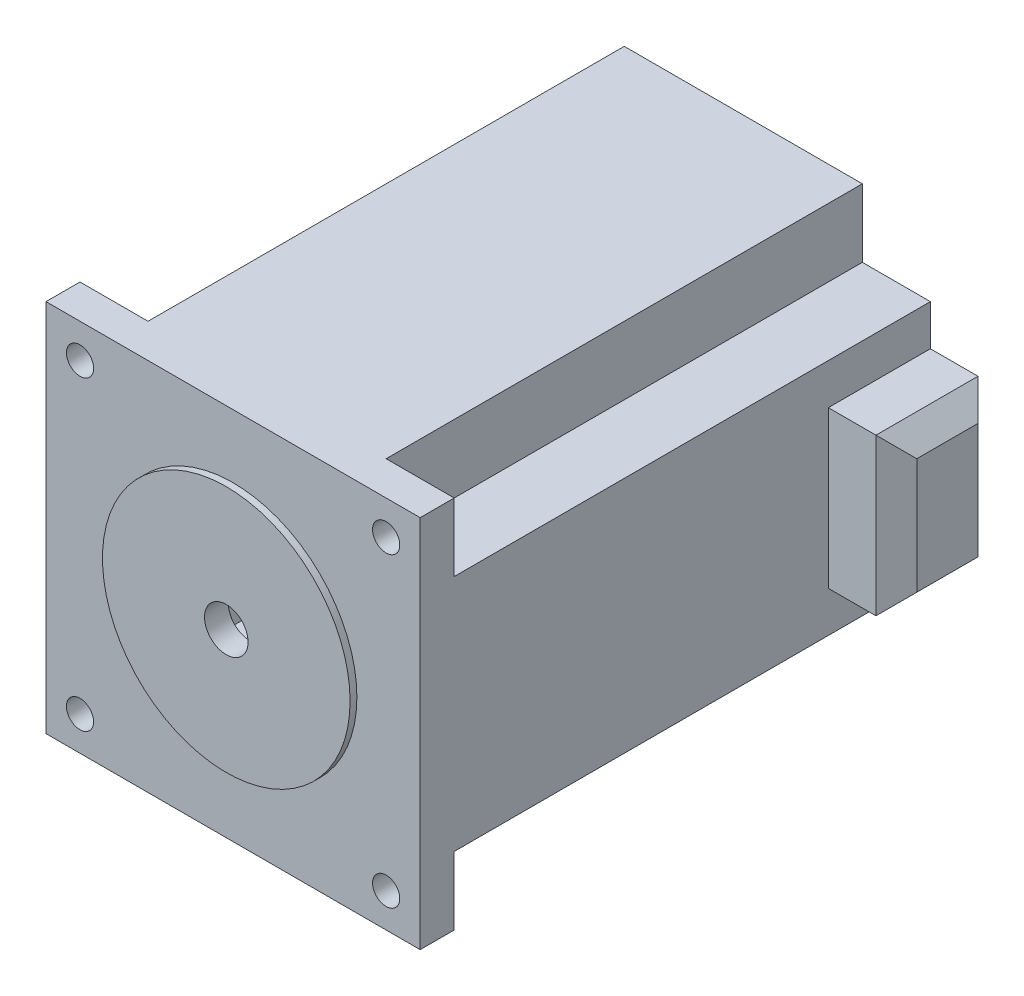
ISO-10303-21;
HEADER;
FILE_DESCRIPTION(('STEP AP214'),'2;1');
FILE_NAME('part.step','',(''),(''),'','','');
FILE_SCHEMA(('AUTOMOTIVE_DESIGN { 1 0 10303 214 1 1 1 1 }'));
ENDSEC;
DATA;
#1=APPLICATION_CONTEXT('core data for automotive mechanical design processes');
#2=APPLICATION_PROTOCOL_DEFINITION('international standard','automotive_design',2000,#1);
#3=PRODUCT_CONTEXT('',#1,'mechanical');
#4=PRODUCT('Part','Part','',(#3));
#5=PRODUCT_RELATED_PRODUCT_CATEGORY('part','',(#4));
#6=PRODUCT_DEFINITION_FORMATION('','',#4);
#7=PRODUCT_DEFINITION_CONTEXT('part definition',#1,'design');
#8=PRODUCT_DEFINITION('design','',#6,#7);
#9=PRODUCT_DEFINITION_SHAPE('','',#8);
#10=(LENGTH_UNIT() NAMED_UNIT(*) SI_UNIT(.MILLI.,.METRE.));
#11=(NAMED_UNIT(*) PLANE_ANGLE_UNIT() SI_UNIT($,.RADIAN.));
#12=(NAMED_UNIT(*) SI_UNIT($,.STERADIAN.) SOLID_ANGLE_UNIT());
#13=UNCERTAINTY_MEASURE_WITH_UNIT(LENGTH_MEASURE(1.E-05),#10,'distance_accuracy_value','');
#14=(GEOMETRIC_REPRESENTATION_CONTEXT(3) GLOBAL_UNCERTAINTY_ASSIGNED_CONTEXT((#13)) GLOBAL_UNIT_ASSIGNED_CONTEXT((#10,
#11,#12)) REPRESENTATION_CONTEXT('',''));
#15=CARTESIAN_POINT('',(0.,0.,0.));
#16=DIRECTION('',(0.,0.,1.));
#17=DIRECTION('',(1.,0.,0.));
#18=AXIS2_PLACEMENT_3D('',#15,#16,#17);
#19=CARTESIAN_POINT('',(27.5,27.5,35.));
#20=DIRECTION('',(-1.,0.,0.));
#21=DIRECTION('',(0.,0.,1.));
#22=AXIS2_PLACEMENT_3D('',#19,#20,#21);
#23=PLANE('',#22);
#24=DIRECTION('',(0.,-1.,0.));
#25=VECTOR('',#24,1.);
#26=CARTESIAN_POINT('',(27.5,-27.5,32.5));
#27=LINE('',#26,#25);
#28=CARTESIAN_POINT('',(27.5,-17.5,32.5));
#29=VERTEX_POINT('',#28);
#30=CARTESIAN_POINT('',(27.5,-27.5,32.5));
#31=VERTEX_POINT('',#30);
#32=EDGE_CURVE('E469',#29,#31,#27,.T.);
#33=ORIENTED_EDGE('',*,*,#32,.F.);
#34=DIRECTION('',(0.,0.,-1.));
#35=VECTOR('',#34,1.);
#36=CARTESIAN_POINT('',(27.5,-17.5,32.5));
#37=LINE('',#36,#35);
#38=CARTESIAN_POINT('',(27.5,-17.5,-37.5));
#39=VERTEX_POINT('',#38);
#40=EDGE_CURVE('E461',#29,#39,#37,.T.);
#41=ORIENTED_EDGE('',*,*,#40,.T.);
#42=DIRECTION('',(0.,-1.,0.));
#43=VECTOR('',#42,1.);
#44=CARTESIAN_POINT('',(27.5,27.5,-37.5));
#45=LINE('',#44,#43);
#46=CARTESIAN_POINT('',(27.5,-11.5,-37.5));
#47=VERTEX_POINT('',#46);
#48=EDGE_CURVE('E318',#47,#39,#45,.T.);
#49=ORIENTED_EDGE('',*,*,#48,.F.);
#50=DIRECTION('',(0.,0.,-1.));
#51=VECTOR('',#50,1.);
#52=CARTESIAN_POINT('',(27.5,-11.5,-22.5));
#53=LINE('',#52,#51);
#54=CARTESIAN_POINT('',(27.5,-11.5,-22.5));
#55=VERTEX_POINT('',#54);
#56=EDGE_CURVE('E282',#55,#47,#53,.T.);
#57=ORIENTED_EDGE('',*,*,#56,.F.);
#58=DIRECTION('',(0.,-1.,0.));
#59=VECTOR('',#58,1.);
#60=CARTESIAN_POINT('',(27.5,11.5,-22.5));
#61=LINE('',#60,#59);
#62=CARTESIAN_POINT('',(27.5,11.5,-22.5));
#63=VERTEX_POINT('',#62);
#64=EDGE_CURVE('E276',#63,#55,#61,.T.);
#65=ORIENTED_EDGE('',*,*,#64,.F.);
#66=DIRECTION('',(0.,0.,1.));
#67=VECTOR('',#66,1.);
#68=CARTESIAN_POINT('',(27.5,11.5,-22.5));
#69=LINE('',#68,#67);
#70=CARTESIAN_POINT('',(27.5,11.5,-37.5));
#71=VERTEX_POINT('',#70);
#72=EDGE_CURVE('E288',#71,#63,#69,.T.);
#73=ORIENTED_EDGE('',*,*,#72,.F.);
#74=CARTESIAN_POINT('',(27.5,17.5,-37.5));
#75=VERTEX_POINT('',#74);
#76=EDGE_CURVE('E321',#75,#71,#45,.T.);
#77=ORIENTED_EDGE('',*,*,#76,.F.);
#78=DIRECTION('',(0.,0.,-1.));
#79=VECTOR('',#78,1.);
#80=CARTESIAN_POINT('',(27.5,17.5,32.5));
#81=LINE('',#80,#79);
#82=CARTESIAN_POINT('',(27.5,17.5,32.5));
#83=VERTEX_POINT('',#82);
#84=EDGE_CURVE('E291',#83,#75,#81,.T.);
#85=ORIENTED_EDGE('',*,*,#84,.F.);
#86=DIRECTION('',(0.,-1.,0.));
#87=VECTOR('',#86,1.);
#88=CARTESIAN_POINT('',(27.5,27.5,32.5));
#89=LINE('',#88,#87);
#90=CARTESIAN_POINT('',(27.5,27.5,32.5));
#91=VERTEX_POINT('',#90);
#92=EDGE_CURVE('E505',#91,#83,#89,.T.);
#93=ORIENTED_EDGE('',*,*,#92,.F.);
#94=DIRECTION('',(0.,0.,-1.));
#95=VECTOR('',#94,1.);
#96=CARTESIAN_POINT('',(27.5,27.5,35.));
#97=LINE('',#96,#95);
#98=CARTESIAN_POINT('',(27.5,27.5,37.5));
#99=VERTEX_POINT('',#98);
#100=EDGE_CURVE('E234',#99,#91,#97,.T.);
#101=ORIENTED_EDGE('',*,*,#100,.F.);
#102=DIRECTION('',(0.,1.,0.));
#103=VECTOR('',#102,1.);
#104=CARTESIAN_POINT('',(27.5,27.5,37.5));
#105=LINE('',#104,#103);
#106=CARTESIAN_POINT('',(27.5,-27.5,37.5));
#107=VERTEX_POINT('',#106);
#108=EDGE_CURVE('E338',#107,#99,#105,.T.);
#109=ORIENTED_EDGE('',*,*,#108,.F.);
#110=DIRECTION('',(0.,0.,-1.));
#111=VECTOR('',#110,1.);
#112=CARTESIAN_POINT('',(27.5,-27.5,35.));
#113=LINE('',#112,#111);
#114=EDGE_CURVE('E238',#107,#31,#113,.T.);
#115=ORIENTED_EDGE('',*,*,#114,.T.);
#116=EDGE_LOOP('',(#33,#41,#49,#57,#65,#73,#77,#85,#93,#101,#109,#115));
#117=FACE_BOUND('',#116,.T.);
#118=ADVANCED_FACE('F33',(#117),#23,.F.);
#119=CARTESIAN_POINT('',(0.,0.,37.5));
#120=DIRECTION('',(0.,0.,1.));
#121=DIRECTION('',(1.,0.,0.));
#122=AXIS2_PLACEMENT_3D('',#119,#120,#121);
#123=PLANE('',#122);
#124=CARTESIAN_POINT('',(22.5,22.5,37.5));
#125=DIRECTION('',(0.,0.,1.));
#126=DIRECTION('',(1.,0.,0.));
#127=AXIS2_PLACEMENT_3D('',#124,#125,#126);
#128=CIRCLE('',#127,2.00000000000001);
#129=CARTESIAN_POINT('',(24.5,22.5,37.5));
#130=VERTEX_POINT('',#129);
#131=EDGE_CURVE('E580',#130,#130,#128,.T.);
#132=ORIENTED_EDGE('',*,*,#131,.F.);
#133=EDGE_LOOP('',(#132));
#134=FACE_BOUND('',#133,.T.);
#135=CARTESIAN_POINT('',(-22.5,-22.5,37.5));
#136=DIRECTION('',(0.,0.,1.));
#137=DIRECTION('',(1.,0.,0.));
#138=AXIS2_PLACEMENT_3D('',#135,#136,#137);
#139=CIRCLE('',#138,2.00000000000001);
#140=CARTESIAN_POINT('',(-20.5,-22.5,37.5));
#141=VERTEX_POINT('',#140);
#142=EDGE_CURVE('E574',#141,#141,#139,.T.);
#143=ORIENTED_EDGE('',*,*,#142,.F.);
#144=EDGE_LOOP('',(#143));
#145=FACE_BOUND('',#144,.T.);
#146=CARTESIAN_POINT('',(22.5,-22.5,37.5));
#147=DIRECTION('',(0.,0.,1.));
#148=DIRECTION('',(1.,0.,0.));
#149=AXIS2_PLACEMENT_3D('',#146,#147,#148);
#150=CIRCLE('',#149,2.00000000000001);
#151=CARTESIAN_POINT('',(24.5,-22.5,37.5));
#152=VERTEX_POINT('',#151);
#153=EDGE_CURVE('E568',#152,#152,#150,.T.);
#154=ORIENTED_EDGE('',*,*,#153,.F.);
#155=EDGE_LOOP('',(#154));
#156=FACE_BOUND('',#155,.T.);
#157=CARTESIAN_POINT('',(-22.5,22.5,37.5));
#158=DIRECTION('',(0.,0.,1.));
#159=DIRECTION('',(1.,0.,0.));
#160=AXIS2_PLACEMENT_3D('',#157,#158,#159);
#161=CIRCLE('',#160,2.00000000000001);
#162=CARTESIAN_POINT('',(-20.5,22.5,37.5));
#163=VERTEX_POINT('',#162);
#164=EDGE_CURVE('E562',#163,#163,#161,.T.);
#165=ORIENTED_EDGE('',*,*,#164,.F.);
#166=EDGE_LOOP('',(#165));
#167=FACE_BOUND('',#166,.T.);
#168=DIRECTION('',(0.,-1.,0.));
#169=VECTOR('',#168,1.);
#170=CARTESIAN_POINT('',(-27.5,27.5,37.5));
#171=LINE('',#170,#169);
#172=CARTESIAN_POINT('',(-27.5,27.5,37.5));
#173=VERTEX_POINT('',#172);
#174=CARTESIAN_POINT('',(-27.5,-27.5,37.5));
#175=VERTEX_POINT('',#174);
#176=EDGE_CURVE('E233',#173,#175,#171,.T.);
#177=ORIENTED_EDGE('',*,*,#176,.T.);
#178=DIRECTION('',(1.,0.,0.));
#179=VECTOR('',#178,1.);
#180=CARTESIAN_POINT('',(-27.5,-27.5,37.5));
#181=LINE('',#180,#179);
#182=EDGE_CURVE('E335',#175,#107,#181,.T.);
#183=ORIENTED_EDGE('',*,*,#182,.T.);
#184=ORIENTED_EDGE('',*,*,#108,.T.);
#185=DIRECTION('',(-1.,0.,0.));
#186=VECTOR('',#185,1.);
#187=CARTESIAN_POINT('',(-27.5,27.5,37.5));
#188=LINE('',#187,#186);
#189=EDGE_CURVE('E341',#99,#173,#188,.T.);
#190=ORIENTED_EDGE('',*,*,#189,.T.);
#191=EDGE_LOOP('',(#177,#183,#184,#190));
#192=FACE_BOUND('',#191,.T.);
#193=CARTESIAN_POINT('',(0.,0.,37.5));
#194=DIRECTION('',(0.,0.,1.));
#195=DIRECTION('',(1.,0.,0.));
#196=AXIS2_PLACEMENT_3D('',#193,#194,#195);
#197=CIRCLE('',#196,18.2);
#198=CARTESIAN_POINT('',(18.2,0.,37.5));
#199=VERTEX_POINT('',#198);
#200=EDGE_CURVE('E308',#199,#199,#197,.T.);
#201=ORIENTED_EDGE('',*,*,#200,.F.);
#202=EDGE_LOOP('',(#201));
#203=FACE_BOUND('',#202,.T.);
#204=ADVANCED_FACE('F401',(#134,#145,#156,#167,#192,#203),#123,.T.);
#205=CARTESIAN_POINT('',(-27.5,27.5,35.));
#206=DIRECTION('',(1.,0.,0.));
#207=DIRECTION('',(0.,1.,0.));
#208=AXIS2_PLACEMENT_3D('',#205,#206,#207);
#209=PLANE('',#208);
#210=DIRECTION('',(0.,1.,0.));
#211=VECTOR('',#210,1.);
#212=CARTESIAN_POINT('',(-27.5,27.5,32.5));
#213=LINE('',#212,#211);
#214=CARTESIAN_POINT('',(-27.5,17.5,32.5));
#215=VERTEX_POINT('',#214);
#216=CARTESIAN_POINT('',(-27.5,27.5,32.5));
#217=VERTEX_POINT('',#216);
#218=EDGE_CURVE('E210',#215,#217,#213,.T.);
#219=ORIENTED_EDGE('',*,*,#218,.F.);
#220=DIRECTION('',(0.,0.,-1.));
#221=VECTOR('',#220,1.);
#222=CARTESIAN_POINT('',(-27.5,17.5,32.5));
#223=LINE('',#222,#221);
#224=CARTESIAN_POINT('',(-27.5,17.5,-37.5));
#225=VERTEX_POINT('',#224);
#226=EDGE_CURVE('E520',#215,#225,#223,.T.);
#227=ORIENTED_EDGE('',*,*,#226,.T.);
#228=DIRECTION('',(0.,1.,0.));
#229=VECTOR('',#228,1.);
#230=CARTESIAN_POINT('',(-27.5,27.5,-37.5));
#231=LINE('',#230,#229);
#232=CARTESIAN_POINT('',(-27.5,-17.5,-37.5));
#233=VERTEX_POINT('',#232);
#234=EDGE_CURVE('E326',#233,#225,#231,.T.);
#235=ORIENTED_EDGE('',*,*,#234,.F.);
#236=DIRECTION('',(0.,0.,-1.));
#237=VECTOR('',#236,1.);
#238=CARTESIAN_POINT('',(-27.5,-17.5,32.5));
#239=LINE('',#238,#237);
#240=CARTESIAN_POINT('',(-27.5,-17.5,32.5));
#241=VERTEX_POINT('',#240);
#242=EDGE_CURVE('E58',#241,#233,#239,.T.);
#243=ORIENTED_EDGE('',*,*,#242,.F.);
#244=DIRECTION('',(0.,1.,0.));
#245=VECTOR('',#244,1.);
#246=CARTESIAN_POINT('',(-27.5,-27.5,32.5));
#247=LINE('',#246,#245);
#248=CARTESIAN_POINT('',(-27.5,-27.5,32.5));
#249=VERTEX_POINT('',#248);
#250=EDGE_CURVE('E484',#249,#241,#247,.T.);
#251=ORIENTED_EDGE('',*,*,#250,.F.);
#252=DIRECTION('',(0.,0.,-1.));
#253=VECTOR('',#252,1.);
#254=CARTESIAN_POINT('',(-27.5,-27.5,35.));
#255=LINE('',#254,#253);
#256=EDGE_CURVE('E247',#175,#249,#255,.T.);
#257=ORIENTED_EDGE('',*,*,#256,.F.);
#258=ORIENTED_EDGE('',*,*,#176,.F.);
#259=DIRECTION('',(0.,0.,-1.));
#260=VECTOR('',#259,1.);
#261=CARTESIAN_POINT('',(-27.5,27.5,35.));
#262=LINE('',#261,#260);
#263=EDGE_CURVE('E226',#173,#217,#262,.T.);
#264=ORIENTED_EDGE('',*,*,#263,.T.);
#265=EDGE_LOOP('',(#219,#227,#235,#243,#251,#257,#258,#264));
#266=FACE_BOUND('',#265,.T.);
#267=ADVANCED_FACE('F231',(#266),#209,.F.);
#268=CARTESIAN_POINT('',(-27.5,-27.5,35.));
#269=DIRECTION('',(0.,1.,0.));
#270=DIRECTION('',(0.,0.,1.));
#271=AXIS2_PLACEMENT_3D('',#268,#269,#270);
#272=PLANE('',#271);
#273=DIRECTION('',(-1.,0.,0.));
#274=VECTOR('',#273,1.);
#275=CARTESIAN_POINT('',(27.5,-27.5,-37.5));
#276=LINE('',#275,#274);
#277=CARTESIAN_POINT('',(17.5,-27.5,-37.5));
#278=VERTEX_POINT('',#277);
#279=CARTESIAN_POINT('',(-17.5,-27.5,-37.5));
#280=VERTEX_POINT('',#279);
#281=EDGE_CURVE('E323',#278,#280,#276,.T.);
#282=ORIENTED_EDGE('',*,*,#281,.F.);
#283=DIRECTION('',(0.,0.,-1.));
#284=VECTOR('',#283,1.);
#285=CARTESIAN_POINT('',(17.5,-27.5,32.5));
#286=LINE('',#285,#284);
#287=CARTESIAN_POINT('',(17.5,-27.5,32.5));
#288=VERTEX_POINT('',#287);
#289=EDGE_CURVE('E481',#288,#278,#286,.T.);
#290=ORIENTED_EDGE('',*,*,#289,.F.);
#291=DIRECTION('',(-1.,0.,0.));
#292=VECTOR('',#291,1.);
#293=CARTESIAN_POINT('',(27.5,-27.5,32.5));
#294=LINE('',#293,#292);
#295=EDGE_CURVE('E471',#31,#288,#294,.T.);
#296=ORIENTED_EDGE('',*,*,#295,.F.);
#297=ORIENTED_EDGE('',*,*,#114,.F.);
#298=ORIENTED_EDGE('',*,*,#182,.F.);
#299=ORIENTED_EDGE('',*,*,#256,.T.);
#300=DIRECTION('',(-1.,0.,0.));
#301=VECTOR('',#300,1.);
#302=CARTESIAN_POINT('',(-27.5,-27.5,32.5));
#303=LINE('',#302,#301);
#304=CARTESIAN_POINT('',(-17.5,-27.5,32.5));
#305=VERTEX_POINT('',#304);
#306=EDGE_CURVE('E494',#305,#249,#303,.T.);
#307=ORIENTED_EDGE('',*,*,#306,.F.);
#308=DIRECTION('',(0.,0.,-1.));
#309=VECTOR('',#308,1.);
#310=CARTESIAN_POINT('',(-17.5,-27.5,32.5));
#311=LINE('',#310,#309);
#312=EDGE_CURVE('E473',#305,#280,#311,.T.);
#313=ORIENTED_EDGE('',*,*,#312,.T.);
#314=EDGE_LOOP('',(#282,#290,#296,#297,#298,#299,#307,#313));
#315=FACE_BOUND('',#314,.T.);
#316=ADVANCED_FACE('F413',(#315),#272,.F.);
#317=CARTESIAN_POINT('',(-27.5,27.5,35.));
#318=DIRECTION('',(0.,-1.,0.));
#319=DIRECTION('',(0.,0.,-1.));
#320=AXIS2_PLACEMENT_3D('',#317,#318,#319);
#321=PLANE('',#320);
#322=DIRECTION('',(1.,0.,0.));
#323=VECTOR('',#322,1.);
#324=CARTESIAN_POINT('',(27.5,27.5,-37.5));
#325=LINE('',#324,#323);
#326=CARTESIAN_POINT('',(-17.5,27.5,-37.5));
#327=VERTEX_POINT('',#326);
#328=CARTESIAN_POINT('',(17.5,27.5,-37.5));
#329=VERTEX_POINT('',#328);
#330=EDGE_CURVE('E329',#327,#329,#325,.T.);
#331=ORIENTED_EDGE('',*,*,#330,.F.);
#332=DIRECTION('',(0.,0.,-1.));
#333=VECTOR('',#332,1.);
#334=CARTESIAN_POINT('',(-17.5,27.5,32.5));
#335=LINE('',#334,#333);
#336=CARTESIAN_POINT('',(-17.5,27.5,32.5));
#337=VERTEX_POINT('',#336);
#338=EDGE_CURVE('E50',#337,#327,#335,.T.);
#339=ORIENTED_EDGE('',*,*,#338,.F.);
#340=DIRECTION('',(1.,0.,0.));
#341=VECTOR('',#340,1.);
#342=CARTESIAN_POINT('',(-27.5,27.5,32.5));
#343=LINE('',#342,#341);
#344=EDGE_CURVE('E214',#217,#337,#343,.T.);
#345=ORIENTED_EDGE('',*,*,#344,.F.);
#346=ORIENTED_EDGE('',*,*,#263,.F.);
#347=ORIENTED_EDGE('',*,*,#189,.F.);
#348=ORIENTED_EDGE('',*,*,#100,.T.);
#349=DIRECTION('',(1.,0.,0.));
#350=VECTOR('',#349,1.);
#351=CARTESIAN_POINT('',(27.5,27.5,32.5));
#352=LINE('',#351,#350);
#353=CARTESIAN_POINT('',(17.5,27.5,32.5));
#354=VERTEX_POINT('',#353);
#355=EDGE_CURVE('E515',#354,#91,#352,.T.);
#356=ORIENTED_EDGE('',*,*,#355,.F.);
#357=DIRECTION('',(0.,0.,-1.));
#358=VECTOR('',#357,1.);
#359=CARTESIAN_POINT('',(17.5,27.5,32.5));
#360=LINE('',#359,#358);
#361=EDGE_CURVE('E268',#354,#329,#360,.T.);
#362=ORIENTED_EDGE('',*,*,#361,.T.);
#363=EDGE_LOOP('',(#331,#339,#345,#346,#347,#348,#356,#362));
#364=FACE_BOUND('',#363,.T.);
#365=ADVANCED_FACE('F224',(#364),#321,.F.);
#366=CARTESIAN_POINT('',(-15.,15.,35.));
#367=DIRECTION('',(1.,0.,0.));
#368=DIRECTION('',(0.,1.,0.));
#369=AXIS2_PLACEMENT_3D('',#366,#367,#368);
#370=PLANE('',#369);
#371=DIRECTION('',(0.,-1.,0.));
#372=VECTOR('',#371,1.);
#373=CARTESIAN_POINT('',(-15.,15.,-35.));
#374=LINE('',#373,#372);
#375=CARTESIAN_POINT('',(-15.,15.,-35.));
#376=VERTEX_POINT('',#375);
#377=CARTESIAN_POINT('',(-15.,-15.,-35.));
#378=VERTEX_POINT('',#377);
#379=EDGE_CURVE('E343',#376,#378,#374,.T.);
#380=ORIENTED_EDGE('',*,*,#379,.F.);
#381=DIRECTION('',(0.,0.,-1.));
#382=VECTOR('',#381,1.);
#383=CARTESIAN_POINT('',(-15.,15.,35.));
#384=LINE('',#383,#382);
#385=CARTESIAN_POINT('',(-15.,15.,35.));
#386=VERTEX_POINT('',#385);
#387=EDGE_CURVE('E357',#386,#376,#384,.T.);
#388=ORIENTED_EDGE('',*,*,#387,.F.);
#389=DIRECTION('',(0.,-1.,0.));
#390=VECTOR('',#389,1.);
#391=CARTESIAN_POINT('',(-15.,15.,35.));
#392=LINE('',#391,#390);
#393=CARTESIAN_POINT('',(-15.,-15.,35.));
#394=VERTEX_POINT('',#393);
#395=EDGE_CURVE('E344',#386,#394,#392,.T.);
#396=ORIENTED_EDGE('',*,*,#395,.T.);
#397=DIRECTION('',(0.,0.,-1.));
#398=VECTOR('',#397,1.);
#399=CARTESIAN_POINT('',(-15.,-15.,35.));
#400=LINE('',#399,#398);
#401=EDGE_CURVE('E235',#394,#378,#400,.T.);
#402=ORIENTED_EDGE('',*,*,#401,.T.);
#403=EDGE_LOOP('',(#380,#388,#396,#402));
#404=FACE_BOUND('',#403,.T.);
#405=ADVANCED_FACE('F385',(#404),#370,.T.);
#406=CARTESIAN_POINT('',(-15.,-15.,35.));
#407=DIRECTION('',(0.,1.,0.));
#408=DIRECTION('',(0.,0.,1.));
#409=AXIS2_PLACEMENT_3D('',#406,#407,#408);
#410=PLANE('',#409);
#411=DIRECTION('',(1.,0.,0.));
#412=VECTOR('',#411,1.);
#413=CARTESIAN_POINT('',(-15.,-15.,-35.));
#414=LINE('',#413,#412);
#415=CARTESIAN_POINT('',(15.,-15.,-35.));
#416=VERTEX_POINT('',#415);
#417=EDGE_CURVE('E360',#378,#416,#414,.T.);
#418=ORIENTED_EDGE('',*,*,#417,.F.);
#419=ORIENTED_EDGE('',*,*,#401,.F.);
#420=DIRECTION('',(1.,0.,0.));
#421=VECTOR('',#420,1.);
#422=CARTESIAN_POINT('',(-15.,-15.,35.));
#423=LINE('',#422,#421);
#424=CARTESIAN_POINT('',(15.,-15.,35.));
#425=VERTEX_POINT('',#424);
#426=EDGE_CURVE('E347',#394,#425,#423,.T.);
#427=ORIENTED_EDGE('',*,*,#426,.T.);
#428=DIRECTION('',(0.,0.,-1.));
#429=VECTOR('',#428,1.);
#430=CARTESIAN_POINT('',(15.,-15.,35.));
#431=LINE('',#430,#429);
#432=EDGE_CURVE('E241',#425,#416,#431,.T.);
#433=ORIENTED_EDGE('',*,*,#432,.T.);
#434=EDGE_LOOP('',(#418,#419,#427,#433));
#435=FACE_BOUND('',#434,.T.);
#436=ADVANCED_FACE('F373',(#435),#410,.T.);
#437=CARTESIAN_POINT('',(15.,15.,35.));
#438=DIRECTION('',(-1.,0.,0.));
#439=DIRECTION('',(0.,-1.,0.));
#440=AXIS2_PLACEMENT_3D('',#437,#438,#439);
#441=PLANE('',#440);
#442=DIRECTION('',(0.,1.,0.));
#443=VECTOR('',#442,1.);
#444=CARTESIAN_POINT('',(15.,15.,-35.));
#445=LINE('',#444,#443);
#446=CARTESIAN_POINT('',(15.,15.,-35.));
#447=VERTEX_POINT('',#446);
#448=EDGE_CURVE('E363',#416,#447,#445,.T.);
#449=ORIENTED_EDGE('',*,*,#448,.F.);
#450=ORIENTED_EDGE('',*,*,#432,.F.);
#451=DIRECTION('',(0.,1.,0.));
#452=VECTOR('',#451,1.);
#453=CARTESIAN_POINT('',(15.,15.,35.));
#454=LINE('',#453,#452);
#455=CARTESIAN_POINT('',(15.,15.,35.));
#456=VERTEX_POINT('',#455);
#457=EDGE_CURVE('E351',#425,#456,#454,.T.);
#458=ORIENTED_EDGE('',*,*,#457,.T.);
#459=DIRECTION('',(0.,0.,-1.));
#460=VECTOR('',#459,1.);
#461=CARTESIAN_POINT('',(15.,15.,35.));
#462=LINE('',#461,#460);
#463=EDGE_CURVE('E369',#456,#447,#462,.T.);
#464=ORIENTED_EDGE('',*,*,#463,.T.);
#465=EDGE_LOOP('',(#449,#450,#458,#464));
#466=FACE_BOUND('',#465,.T.);
#467=ADVANCED_FACE('F376',(#466),#441,.T.);
#468=CARTESIAN_POINT('',(-15.,15.,35.));
#469=DIRECTION('',(0.,-1.,0.));
#470=DIRECTION('',(0.,0.,-1.));
#471=AXIS2_PLACEMENT_3D('',#468,#469,#470);
#472=PLANE('',#471);
#473=DIRECTION('',(-1.,0.,0.));
#474=VECTOR('',#473,1.);
#475=CARTESIAN_POINT('',(-15.,15.,-35.));
#476=LINE('',#475,#474);
#477=EDGE_CURVE('E348',#447,#376,#476,.T.);
#478=ORIENTED_EDGE('',*,*,#477,.F.);
#479=ORIENTED_EDGE('',*,*,#463,.F.);
#480=DIRECTION('',(-1.,0.,0.));
#481=VECTOR('',#480,1.);
#482=CARTESIAN_POINT('',(-15.,15.,35.));
#483=LINE('',#482,#481);
#484=EDGE_CURVE('E354',#456,#386,#483,.T.);
#485=ORIENTED_EDGE('',*,*,#484,.T.);
#486=ORIENTED_EDGE('',*,*,#387,.T.);
#487=EDGE_LOOP('',(#478,#479,#485,#486));
#488=FACE_BOUND('',#487,.T.);
#489=ADVANCED_FACE('F390',(#488),#472,.T.);
#490=CARTESIAN_POINT('',(0.,0.,35.));
#491=DIRECTION('',(0.,0.,1.));
#492=DIRECTION('',(1.,0.,0.));
#493=AXIS2_PLACEMENT_3D('',#490,#491,#492);
#494=PLANE('',#493);
#495=ORIENTED_EDGE('',*,*,#395,.F.);
#496=ORIENTED_EDGE('',*,*,#484,.F.);
#497=ORIENTED_EDGE('',*,*,#457,.F.);
#498=ORIENTED_EDGE('',*,*,#426,.F.);
#499=EDGE_LOOP('',(#495,#496,#497,#498));
#500=FACE_BOUND('',#499,.T.);
#501=CARTESIAN_POINT('',(0.,0.,35.));
#502=DIRECTION('',(0.,0.,1.));
#503=DIRECTION('',(1.,0.,0.));
#504=AXIS2_PLACEMENT_3D('',#501,#502,#503);
#505=CIRCLE('',#504,3.2);
#506=CARTESIAN_POINT('',(3.2,0.,35.));
#507=VERTEX_POINT('',#506);
#508=EDGE_CURVE('E331',#507,#507,#505,.T.);
#509=ORIENTED_EDGE('',*,*,#508,.T.);
#510=EDGE_LOOP('',(#509));
#511=FACE_BOUND('',#510,.T.);
#512=ADVANCED_FACE('F387',(#500,#511),#494,.F.);
#513=CARTESIAN_POINT('',(0.,0.,37.5));
#514=DIRECTION('',(0.,0.,-1.));
#515=DIRECTION('',(-1.,0.,0.));
#516=AXIS2_PLACEMENT_3D('',#513,#514,#515);
#517=CYLINDRICAL_SURFACE('',#516,3.2);
#518=ORIENTED_EDGE('',*,*,#508,.F.);
#519=EDGE_LOOP('',(#518));
#520=FACE_BOUND('',#519,.T.);
#521=CARTESIAN_POINT('',(0.,0.,38.5));
#522=DIRECTION('',(0.,0.,1.));
#523=DIRECTION('',(1.,0.,0.));
#524=AXIS2_PLACEMENT_3D('',#521,#522,#523);
#525=CIRCLE('',#524,3.2);
#526=CARTESIAN_POINT('',(3.2,0.,38.5));
#527=VERTEX_POINT('',#526);
#528=EDGE_CURVE('E305',#527,#527,#525,.T.);
#529=ORIENTED_EDGE('',*,*,#528,.T.);
#530=EDGE_LOOP('',(#529));
#531=FACE_BOUND('',#530,.T.);
#532=ADVANCED_FACE('F397',(#520,#531),#517,.F.);
#533=CARTESIAN_POINT('',(0.,0.,-37.5));
#534=DIRECTION('',(0.,0.,-1.));
#535=DIRECTION('',(-1.,0.,0.));
#536=AXIS2_PLACEMENT_3D('',#533,#534,#535);
#537=PLANE('',#536);
#538=DIRECTION('',(-1.,0.,0.));
#539=VECTOR('',#538,1.);
#540=CARTESIAN_POINT('',(-27.5,17.5,-37.5));
#541=LINE('',#540,#539);
#542=CARTESIAN_POINT('',(-17.5,17.5,-37.5));
#543=VERTEX_POINT('',#542);
#544=EDGE_CURVE('E220',#543,#225,#541,.T.);
#545=ORIENTED_EDGE('',*,*,#544,.F.);
#546=DIRECTION('',(0.,-1.,0.));
#547=VECTOR('',#546,1.);
#548=CARTESIAN_POINT('',(-17.5,27.5,-37.5));
#549=LINE('',#548,#547);
#550=EDGE_CURVE('E478',#327,#543,#549,.T.);
#551=ORIENTED_EDGE('',*,*,#550,.F.);
#552=ORIENTED_EDGE('',*,*,#330,.T.);
#553=DIRECTION('',(0.,1.,0.));
#554=VECTOR('',#553,1.);
#555=CARTESIAN_POINT('',(17.5,27.5,-37.5));
#556=LINE('',#555,#554);
#557=CARTESIAN_POINT('',(17.5,17.5,-37.5));
#558=VERTEX_POINT('',#557);
#559=EDGE_CURVE('E509',#558,#329,#556,.T.);
#560=ORIENTED_EDGE('',*,*,#559,.F.);
#561=DIRECTION('',(-1.,0.,0.));
#562=VECTOR('',#561,1.);
#563=CARTESIAN_POINT('',(27.5,17.5,-37.5));
#564=LINE('',#563,#562);
#565=EDGE_CURVE('E517',#75,#558,#564,.T.);
#566=ORIENTED_EDGE('',*,*,#565,.F.);
#567=ORIENTED_EDGE('',*,*,#76,.T.);
#568=DIRECTION('',(-1.,0.,0.));
#569=VECTOR('',#568,1.);
#570=CARTESIAN_POINT('',(37.5,11.5,-37.5));
#571=LINE('',#570,#569);
#572=CARTESIAN_POINT('',(34.5,11.5,-37.5));
#573=VERTEX_POINT('',#572);
#574=EDGE_CURVE('E298',#573,#71,#571,.T.);
#575=ORIENTED_EDGE('',*,*,#574,.F.);
#576=DIRECTION('',(0.,-1.,0.));
#577=VECTOR('',#576,1.);
#578=CARTESIAN_POINT('',(34.5,0.,-37.5));
#579=LINE('',#578,#577);
#580=CARTESIAN_POINT('',(34.5,-11.5,-37.5));
#581=VERTEX_POINT('',#580);
#582=EDGE_CURVE('E262',#573,#581,#579,.T.);
#583=ORIENTED_EDGE('',*,*,#582,.T.);
#584=DIRECTION('',(-1.,0.,0.));
#585=VECTOR('',#584,1.);
#586=CARTESIAN_POINT('',(37.5,-11.5,-37.5));
#587=LINE('',#586,#585);
#588=EDGE_CURVE('E301',#581,#47,#587,.T.);
#589=ORIENTED_EDGE('',*,*,#588,.T.);
#590=ORIENTED_EDGE('',*,*,#48,.T.);
#591=DIRECTION('',(1.,0.,0.));
#592=VECTOR('',#591,1.);
#593=CARTESIAN_POINT('',(27.5,-17.5,-37.5));
#594=LINE('',#593,#592);
#595=CARTESIAN_POINT('',(17.5,-17.5,-37.5));
#596=VERTEX_POINT('',#595);
#597=EDGE_CURVE('E464',#596,#39,#594,.T.);
#598=ORIENTED_EDGE('',*,*,#597,.F.);
#599=DIRECTION('',(0.,1.,0.));
#600=VECTOR('',#599,1.);
#601=CARTESIAN_POINT('',(17.5,-27.5,-37.5));
#602=LINE('',#601,#600);
#603=EDGE_CURVE('E466',#278,#596,#602,.T.);
#604=ORIENTED_EDGE('',*,*,#603,.F.);
#605=ORIENTED_EDGE('',*,*,#281,.T.);
#606=DIRECTION('',(0.,-1.,0.));
#607=VECTOR('',#606,1.);
#608=CARTESIAN_POINT('',(-17.5,-27.5,-37.5));
#609=LINE('',#608,#607);
#610=CARTESIAN_POINT('',(-17.5,-17.5,-37.5));
#611=VERTEX_POINT('',#610);
#612=EDGE_CURVE('E488',#611,#280,#609,.T.);
#613=ORIENTED_EDGE('',*,*,#612,.F.);
#614=DIRECTION('',(1.,0.,0.));
#615=VECTOR('',#614,1.);
#616=CARTESIAN_POINT('',(-27.5,-17.5,-37.5));
#617=LINE('',#616,#615);
#618=EDGE_CURVE('E496',#233,#611,#617,.T.);
#619=ORIENTED_EDGE('',*,*,#618,.F.);
#620=ORIENTED_EDGE('',*,*,#234,.T.);
#621=EDGE_LOOP('',(#545,#551,#552,#560,#566,#567,#575,#583,#589,#590,#598,#604,#605,#613,#619,#620));
#622=FACE_BOUND('',#621,.T.);
#623=CARTESIAN_POINT('',(0.,0.,-37.5));
#624=DIRECTION('',(0.,0.,-1.));
#625=DIRECTION('',(-1.,0.,0.));
#626=AXIS2_PLACEMENT_3D('',#623,#624,#625);
#627=CIRCLE('',#626,3.2);
#628=CARTESIAN_POINT('',(-3.2,0.,-37.5));
#629=VERTEX_POINT('',#628);
#630=EDGE_CURVE('E315',#629,#629,#627,.T.);
#631=ORIENTED_EDGE('',*,*,#630,.F.);
#632=EDGE_LOOP('',(#631));
#633=FACE_BOUND('',#632,.T.);
#634=ADVANCED_FACE('F453',(#622,#633),#537,.T.);
#635=CARTESIAN_POINT('',(0.,0.,-35.));
#636=DIRECTION('',(0.,0.,-1.));
#637=DIRECTION('',(-1.,0.,0.));
#638=AXIS2_PLACEMENT_3D('',#635,#636,#637);
#639=PLANE('',#638);
#640=ORIENTED_EDGE('',*,*,#379,.T.);
#641=ORIENTED_EDGE('',*,*,#417,.T.);
#642=ORIENTED_EDGE('',*,*,#448,.T.);
#643=ORIENTED_EDGE('',*,*,#477,.T.);
#644=EDGE_LOOP('',(#640,#641,#642,#643));
#645=FACE_BOUND('',#644,.T.);
#646=CARTESIAN_POINT('',(0.,0.,-35.));
#647=DIRECTION('',(0.,0.,-1.));
#648=DIRECTION('',(-1.,0.,0.));
#649=AXIS2_PLACEMENT_3D('',#646,#647,#648);
#650=CIRCLE('',#649,3.2);
#651=CARTESIAN_POINT('',(-3.2,0.,-35.));
#652=VERTEX_POINT('',#651);
#653=EDGE_CURVE('E312',#652,#652,#650,.T.);
#654=ORIENTED_EDGE('',*,*,#653,.T.);
#655=EDGE_LOOP('',(#654));
#656=FACE_BOUND('',#655,.T.);
#657=ADVANCED_FACE('F380',(#645,#656),#639,.F.);
#658=CARTESIAN_POINT('',(0.,0.,-37.5));
#659=DIRECTION('',(0.,0.,1.));
#660=DIRECTION('',(1.,0.,0.));
#661=AXIS2_PLACEMENT_3D('',#658,#659,#660);
#662=CYLINDRICAL_SURFACE('',#661,3.2);
#663=ORIENTED_EDGE('',*,*,#630,.T.);
#664=EDGE_LOOP('',(#663));
#665=FACE_BOUND('',#664,.T.);
#666=ORIENTED_EDGE('',*,*,#653,.F.);
#667=EDGE_LOOP('',(#666));
#668=FACE_BOUND('',#667,.T.);
#669=ADVANCED_FACE('F660',(#665,#668),#662,.F.);
#670=CARTESIAN_POINT('',(0.,0.,38.5));
#671=DIRECTION('',(0.,0.,1.));
#672=DIRECTION('',(1.,0.,0.));
#673=AXIS2_PLACEMENT_3D('',#670,#671,#672);
#674=PLANE('',#673);
#675=CARTESIAN_POINT('',(0.,0.,38.5));
#676=DIRECTION('',(0.,0.,1.));
#677=DIRECTION('',(1.,0.,0.));
#678=AXIS2_PLACEMENT_3D('',#675,#676,#677);
#679=CIRCLE('',#678,18.2);
#680=CARTESIAN_POINT('',(18.2,0.,38.5));
#681=VERTEX_POINT('',#680);
#682=EDGE_CURVE('E309',#681,#681,#679,.T.);
#683=ORIENTED_EDGE('',*,*,#682,.T.);
#684=EDGE_LOOP('',(#683));
#685=FACE_BOUND('',#684,.T.);
#686=ORIENTED_EDGE('',*,*,#528,.F.);
#687=EDGE_LOOP('',(#686));
#688=FACE_BOUND('',#687,.T.);
#689=ADVANCED_FACE('F657',(#685,#688),#674,.T.);
#690=CARTESIAN_POINT('',(0.,0.,38.5));
#691=DIRECTION('',(0.,0.,-1.));
#692=DIRECTION('',(-1.,0.,0.));
#693=AXIS2_PLACEMENT_3D('',#690,#691,#692);
#694=CYLINDRICAL_SURFACE('',#693,18.2);
#695=ORIENTED_EDGE('',*,*,#682,.F.);
#696=EDGE_LOOP('',(#695));
#697=FACE_BOUND('',#696,.T.);
#698=ORIENTED_EDGE('',*,*,#200,.T.);
#699=EDGE_LOOP('',(#698));
#700=FACE_BOUND('',#699,.T.);
#701=ADVANCED_FACE('F656',(#697,#700),#694,.T.);
#702=CARTESIAN_POINT('',(37.5,11.5,-22.5));
#703=DIRECTION('',(0.,0.,-1.));
#704=DIRECTION('',(0.,1.,0.));
#705=AXIS2_PLACEMENT_3D('',#702,#703,#704);
#706=PLANE('',#705);
#707=DIRECTION('',(-1.,0.,0.));
#708=VECTOR('',#707,1.);
#709=CARTESIAN_POINT('',(37.5,-11.5,-22.5));
#710=LINE('',#709,#708);
#711=CARTESIAN_POINT('',(34.5,-11.5,-22.5));
#712=VERTEX_POINT('',#711);
#713=EDGE_CURVE('E303',#712,#55,#710,.T.);
#714=ORIENTED_EDGE('',*,*,#713,.F.);
#715=DIRECTION('',(0.,1.,0.));
#716=VECTOR('',#715,1.);
#717=CARTESIAN_POINT('',(34.5,11.5,-22.5));
#718=LINE('',#717,#716);
#719=CARTESIAN_POINT('',(34.5,11.5,-22.5));
#720=VERTEX_POINT('',#719);
#721=EDGE_CURVE('E11',#712,#720,#718,.T.);
#722=ORIENTED_EDGE('',*,*,#721,.T.);
#723=DIRECTION('',(-1.,0.,0.));
#724=VECTOR('',#723,1.);
#725=CARTESIAN_POINT('',(37.5,11.5,-22.5));
#726=LINE('',#725,#724);
#727=EDGE_CURVE('E296',#720,#63,#726,.T.);
#728=ORIENTED_EDGE('',*,*,#727,.T.);
#729=ORIENTED_EDGE('',*,*,#64,.T.);
#730=EDGE_LOOP('',(#714,#722,#728,#729));
#731=FACE_BOUND('',#730,.T.);
#732=ADVANCED_FACE('F443',(#731),#706,.F.);
#733=CARTESIAN_POINT('',(37.5,-11.5,-22.5));
#734=DIRECTION('',(0.,1.,0.));
#735=DIRECTION('',(0.,0.,1.));
#736=AXIS2_PLACEMENT_3D('',#733,#734,#735);
#737=PLANE('',#736);
#738=ORIENTED_EDGE('',*,*,#588,.F.);
#739=DIRECTION('',(0.,0.,1.));
#740=VECTOR('',#739,1.);
#741=CARTESIAN_POINT('',(34.5,-11.5,-22.5));
#742=LINE('',#741,#740);
#743=EDGE_CURVE('E42',#581,#712,#742,.T.);
#744=ORIENTED_EDGE('',*,*,#743,.T.);
#745=ORIENTED_EDGE('',*,*,#713,.T.);
#746=ORIENTED_EDGE('',*,*,#56,.T.);
#747=EDGE_LOOP('',(#738,#744,#745,#746));
#748=FACE_BOUND('',#747,.T.);
#749=ADVANCED_FACE('F458',(#748),#737,.F.);
#750=CARTESIAN_POINT('',(37.5,11.5,-22.5));
#751=DIRECTION('',(0.,-1.,0.));
#752=DIRECTION('',(0.,0.,-1.));
#753=AXIS2_PLACEMENT_3D('',#750,#751,#752);
#754=PLANE('',#753);
#755=ORIENTED_EDGE('',*,*,#727,.F.);
#756=DIRECTION('',(0.,0.,-1.));
#757=VECTOR('',#756,1.);
#758=CARTESIAN_POINT('',(34.5,11.5,-37.5));
#759=LINE('',#758,#757);
#760=EDGE_CURVE('E259',#720,#573,#759,.T.);
#761=ORIENTED_EDGE('',*,*,#760,.T.);
#762=ORIENTED_EDGE('',*,*,#574,.T.);
#763=ORIENTED_EDGE('',*,*,#72,.T.);
#764=EDGE_LOOP('',(#755,#761,#762,#763));
#765=FACE_BOUND('',#764,.T.);
#766=ADVANCED_FACE('F436',(#765),#754,.F.);
#767=CARTESIAN_POINT('',(37.5,0.,0.));
#768=DIRECTION('',(1.,0.,0.));
#769=DIRECTION('',(0.,0.,-1.));
#770=AXIS2_PLACEMENT_3D('',#767,#768,#769);
#771=PLANE('',#770);
#772=DIRECTION('',(0.,1.,0.));
#773=VECTOR('',#772,1.);
#774=CARTESIAN_POINT('',(37.5,0.,-34.5));
#775=LINE('',#774,#773);
#776=CARTESIAN_POINT('',(37.5,-8.49999999999999,-34.5));
#777=VERTEX_POINT('',#776);
#778=CARTESIAN_POINT('',(37.5,8.49999999999999,-34.5));
#779=VERTEX_POINT('',#778);
#780=EDGE_CURVE('E254',#777,#779,#775,.T.);
#781=ORIENTED_EDGE('',*,*,#780,.T.);
#782=DIRECTION('',(0.,0.,1.));
#783=VECTOR('',#782,1.);
#784=CARTESIAN_POINT('',(37.5,8.5,-22.5));
#785=LINE('',#784,#783);
#786=CARTESIAN_POINT('',(37.5,8.5,-25.5));
#787=VERTEX_POINT('',#786);
#788=EDGE_CURVE('E256',#779,#787,#785,.T.);
#789=ORIENTED_EDGE('',*,*,#788,.T.);
#790=DIRECTION('',(0.,-1.,0.));
#791=VECTOR('',#790,1.);
#792=CARTESIAN_POINT('',(37.5,-11.5,-25.5));
#793=LINE('',#792,#791);
#794=CARTESIAN_POINT('',(37.5,-8.49999999999999,-25.5));
#795=VERTEX_POINT('',#794);
#796=EDGE_CURVE('E250',#787,#795,#793,.T.);
#797=ORIENTED_EDGE('',*,*,#796,.T.);
#798=DIRECTION('',(0.,0.,-1.));
#799=VECTOR('',#798,1.);
#800=CARTESIAN_POINT('',(37.5,-8.49999999999999,-37.5));
#801=LINE('',#800,#799);
#802=EDGE_CURVE('E252',#795,#777,#801,.T.);
#803=ORIENTED_EDGE('',*,*,#802,.T.);
#804=EDGE_LOOP('',(#781,#789,#797,#803));
#805=FACE_BOUND('',#804,.T.);
#806=ADVANCED_FACE('F431',(#805),#771,.T.);
#807=CARTESIAN_POINT('',(37.5,-8.50000000000001,0.));
#808=DIRECTION('',(0.707106781186546,-0.707106781186549,0.));
#809=DIRECTION('',(0.,0.,1.));
#810=AXIS2_PLACEMENT_3D('',#807,#808,#809);
#811=PLANE('',#810);
#812=DIRECTION('',(0.577350269189628,0.577350269189625,-0.577350269189625));
#813=VECTOR('',#812,1.);
#814=CARTESIAN_POINT('',(40.3333333333333,-5.66666666666667,-28.3333333333333));
#815=LINE('',#814,#813);
#816=EDGE_CURVE('E269',#712,#795,#815,.T.);
#817=ORIENTED_EDGE('',*,*,#816,.F.);
#818=ORIENTED_EDGE('',*,*,#743,.F.);
#819=DIRECTION('',(-0.577350269189628,-0.577350269189625,-0.577350269189625));
#820=VECTOR('',#819,1.);
#821=CARTESIAN_POINT('',(49.,2.99999999999996,-23.));
#822=LINE('',#821,#820);
#823=EDGE_CURVE('E37',#777,#581,#822,.T.);
#824=ORIENTED_EDGE('',*,*,#823,.F.);
#825=ORIENTED_EDGE('',*,*,#802,.F.);
#826=EDGE_LOOP('',(#817,#818,#824,#825));
#827=FACE_BOUND('',#826,.T.);
#828=ADVANCED_FACE('F35',(#827),#811,.T.);
#829=CARTESIAN_POINT('',(37.5,0.,-34.5));
#830=DIRECTION('',(-0.707106781186546,0.,0.707106781186549));
#831=DIRECTION('',(0.,1.,0.));
#832=AXIS2_PLACEMENT_3D('',#829,#830,#831);
#833=PLANE('',#832);
#834=ORIENTED_EDGE('',*,*,#823,.T.);
#835=ORIENTED_EDGE('',*,*,#582,.F.);
#836=DIRECTION('',(-0.577350269189628,0.577350269189625,-0.577350269189625));
#837=VECTOR('',#836,1.);
#838=CARTESIAN_POINT('',(40.3333333333333,5.66666666666667,-31.6666666666667));
#839=LINE('',#838,#837);
#840=EDGE_CURVE('E267',#779,#573,#839,.T.);
#841=ORIENTED_EDGE('',*,*,#840,.F.);
#842=ORIENTED_EDGE('',*,*,#780,.F.);
#843=EDGE_LOOP('',(#834,#835,#841,#842));
#844=FACE_BOUND('',#843,.T.);
#845=ADVANCED_FACE('F426',(#844),#833,.F.);
#846=CARTESIAN_POINT('',(37.5,0.,-25.5));
#847=DIRECTION('',(0.707106781186546,0.,0.707106781186549));
#848=DIRECTION('',(0.,1.,0.));
#849=AXIS2_PLACEMENT_3D('',#846,#847,#848);
#850=PLANE('',#849);
#851=ORIENTED_EDGE('',*,*,#816,.T.);
#852=ORIENTED_EDGE('',*,*,#796,.F.);
#853=DIRECTION('',(-0.577350269189627,0.577350269189625,0.577350269189625));
#854=VECTOR('',#853,1.);
#855=CARTESIAN_POINT('',(40.3333333333333,5.66666666666667,-28.3333333333333));
#856=LINE('',#855,#854);
#857=EDGE_CURVE('E265',#720,#787,#856,.F.);
#858=ORIENTED_EDGE('',*,*,#857,.F.);
#859=ORIENTED_EDGE('',*,*,#721,.F.);
#860=EDGE_LOOP('',(#851,#852,#858,#859));
#861=FACE_BOUND('',#860,.T.);
#862=ADVANCED_FACE('F423',(#861),#850,.T.);
#863=CARTESIAN_POINT('',(37.5,8.5,0.));
#864=DIRECTION('',(0.707106781186546,0.707106781186549,0.));
#865=DIRECTION('',(0.,0.,-1.));
#866=AXIS2_PLACEMENT_3D('',#863,#864,#865);
#867=PLANE('',#866);
#868=ORIENTED_EDGE('',*,*,#840,.T.);
#869=ORIENTED_EDGE('',*,*,#760,.F.);
#870=ORIENTED_EDGE('',*,*,#857,.T.);
#871=ORIENTED_EDGE('',*,*,#788,.F.);
#872=EDGE_LOOP('',(#868,#869,#870,#871));
#873=FACE_BOUND('',#872,.T.);
#874=ADVANCED_FACE('F419',(#873),#867,.T.);
#875=CARTESIAN_POINT('',(17.5,27.5,32.5));
#876=DIRECTION('',(-1.,0.,0.));
#877=DIRECTION('',(0.,0.,1.));
#878=AXIS2_PLACEMENT_3D('',#875,#876,#877);
#879=PLANE('',#878);
#880=ORIENTED_EDGE('',*,*,#559,.T.);
#881=ORIENTED_EDGE('',*,*,#361,.F.);
#882=DIRECTION('',(0.,1.,0.));
#883=VECTOR('',#882,1.);
#884=CARTESIAN_POINT('',(17.5,27.5,32.5));
#885=LINE('',#884,#883);
#886=CARTESIAN_POINT('',(17.5,17.5,32.5));
#887=VERTEX_POINT('',#886);
#888=EDGE_CURVE('E512',#887,#354,#885,.T.);
#889=ORIENTED_EDGE('',*,*,#888,.F.);
#890=DIRECTION('',(0.,0.,-1.));
#891=VECTOR('',#890,1.);
#892=CARTESIAN_POINT('',(17.5,17.5,32.5));
#893=LINE('',#892,#891);
#894=EDGE_CURVE('E524',#887,#558,#893,.T.);
#895=ORIENTED_EDGE('',*,*,#894,.T.);
#896=EDGE_LOOP('',(#880,#881,#889,#895));
#897=FACE_BOUND('',#896,.T.);
#898=ADVANCED_FACE('F422',(#897),#879,.F.);
#899=CARTESIAN_POINT('',(27.5,17.5,32.5));
#900=DIRECTION('',(0.,-1.,0.));
#901=DIRECTION('',(0.,0.,-1.));
#902=AXIS2_PLACEMENT_3D('',#899,#900,#901);
#903=PLANE('',#902);
#904=ORIENTED_EDGE('',*,*,#565,.T.);
#905=ORIENTED_EDGE('',*,*,#894,.F.);
#906=DIRECTION('',(-1.,0.,0.));
#907=VECTOR('',#906,1.);
#908=CARTESIAN_POINT('',(27.5,17.5,32.5));
#909=LINE('',#908,#907);
#910=EDGE_CURVE('E508',#83,#887,#909,.T.);
#911=ORIENTED_EDGE('',*,*,#910,.F.);
#912=ORIENTED_EDGE('',*,*,#84,.T.);
#913=EDGE_LOOP('',(#904,#905,#911,#912));
#914=FACE_BOUND('',#913,.T.);
#915=ADVANCED_FACE('F530',(#914),#903,.F.);
#916=CARTESIAN_POINT('',(0.,0.,32.5));
#917=DIRECTION('',(0.,0.,-1.));
#918=DIRECTION('',(-1.,0.,0.));
#919=AXIS2_PLACEMENT_3D('',#916,#917,#918);
#920=PLANE('',#919);
#921=CARTESIAN_POINT('',(22.5,22.5,32.5));
#922=DIRECTION('',(0.,0.,1.));
#923=DIRECTION('',(1.,0.,0.));
#924=AXIS2_PLACEMENT_3D('',#921,#922,#923);
#925=CIRCLE('',#924,2.00000000000001);
#926=CARTESIAN_POINT('',(24.5,22.5,32.5));
#927=VERTEX_POINT('',#926);
#928=EDGE_CURVE('E565',#927,#927,#925,.T.);
#929=ORIENTED_EDGE('',*,*,#928,.T.);
#930=EDGE_LOOP('',(#929));
#931=FACE_BOUND('',#930,.T.);
#932=ORIENTED_EDGE('',*,*,#92,.T.);
#933=ORIENTED_EDGE('',*,*,#910,.T.);
#934=ORIENTED_EDGE('',*,*,#888,.T.);
#935=ORIENTED_EDGE('',*,*,#355,.T.);
#936=EDGE_LOOP('',(#932,#933,#934,#935));
#937=FACE_BOUND('',#936,.T.);
#938=ADVANCED_FACE('F536',(#931,#937),#920,.T.);
#939=CARTESIAN_POINT('',(-17.5,-27.5,32.5));
#940=DIRECTION('',(1.,0.,0.));
#941=DIRECTION('',(0.,0.,-1.));
#942=AXIS2_PLACEMENT_3D('',#939,#940,#941);
#943=PLANE('',#942);
#944=ORIENTED_EDGE('',*,*,#612,.T.);
#945=ORIENTED_EDGE('',*,*,#312,.F.);
#946=DIRECTION('',(0.,-1.,0.));
#947=VECTOR('',#946,1.);
#948=CARTESIAN_POINT('',(-17.5,-27.5,32.5));
#949=LINE('',#948,#947);
#950=CARTESIAN_POINT('',(-17.5,-17.5,32.5));
#951=VERTEX_POINT('',#950);
#952=EDGE_CURVE('E491',#951,#305,#949,.T.);
#953=ORIENTED_EDGE('',*,*,#952,.F.);
#954=DIRECTION('',(0.,0.,-1.));
#955=VECTOR('',#954,1.);
#956=CARTESIAN_POINT('',(-17.5,-17.5,32.5));
#957=LINE('',#956,#955);
#958=EDGE_CURVE('E502',#951,#611,#957,.T.);
#959=ORIENTED_EDGE('',*,*,#958,.T.);
#960=EDGE_LOOP('',(#944,#945,#953,#959));
#961=FACE_BOUND('',#960,.T.);
#962=ADVANCED_FACE('F638',(#961),#943,.F.);
#963=CARTESIAN_POINT('',(-27.5,-17.5,32.5));
#964=DIRECTION('',(0.,1.,0.));
#965=DIRECTION('',(0.,0.,1.));
#966=AXIS2_PLACEMENT_3D('',#963,#964,#965);
#967=PLANE('',#966);
#968=ORIENTED_EDGE('',*,*,#618,.T.);
#969=ORIENTED_EDGE('',*,*,#958,.F.);
#970=DIRECTION('',(1.,0.,0.));
#971=VECTOR('',#970,1.);
#972=CARTESIAN_POINT('',(-27.5,-17.5,32.5));
#973=LINE('',#972,#971);
#974=EDGE_CURVE('E487',#241,#951,#973,.T.);
#975=ORIENTED_EDGE('',*,*,#974,.F.);
#976=ORIENTED_EDGE('',*,*,#242,.T.);
#977=EDGE_LOOP('',(#968,#969,#975,#976));
#978=FACE_BOUND('',#977,.T.);
#979=ADVANCED_FACE('F636',(#978),#967,.F.);
#980=CARTESIAN_POINT('',(0.,0.,32.5));
#981=DIRECTION('',(0.,0.,-1.));
#982=DIRECTION('',(-1.,0.,0.));
#983=AXIS2_PLACEMENT_3D('',#980,#981,#982);
#984=PLANE('',#983);
#985=CARTESIAN_POINT('',(-22.5,-22.5,32.5));
#986=DIRECTION('',(0.,0.,1.));
#987=DIRECTION('',(1.,0.,0.));
#988=AXIS2_PLACEMENT_3D('',#985,#986,#987);
#989=CIRCLE('',#988,2.00000000000001);
#990=CARTESIAN_POINT('',(-20.5,-22.5,32.5));
#991=VERTEX_POINT('',#990);
#992=EDGE_CURVE('E577',#991,#991,#989,.T.);
#993=ORIENTED_EDGE('',*,*,#992,.T.);
#994=EDGE_LOOP('',(#993));
#995=FACE_BOUND('',#994,.T.);
#996=ORIENTED_EDGE('',*,*,#250,.T.);
#997=ORIENTED_EDGE('',*,*,#974,.T.);
#998=ORIENTED_EDGE('',*,*,#952,.T.);
#999=ORIENTED_EDGE('',*,*,#306,.T.);
#1000=EDGE_LOOP('',(#996,#997,#998,#999));
#1001=FACE_BOUND('',#1000,.T.);
#1002=ADVANCED_FACE('F630',(#995,#1001),#984,.T.);
#1003=CARTESIAN_POINT('',(27.5,-17.5,32.5));
#1004=DIRECTION('',(0.,1.,0.));
#1005=DIRECTION('',(0.,0.,1.));
#1006=AXIS2_PLACEMENT_3D('',#1003,#1004,#1005);
#1007=PLANE('',#1006);
#1008=ORIENTED_EDGE('',*,*,#597,.T.);
#1009=ORIENTED_EDGE('',*,*,#40,.F.);
#1010=DIRECTION('',(1.,0.,0.));
#1011=VECTOR('',#1010,1.);
#1012=CARTESIAN_POINT('',(27.5,-17.5,32.5));
#1013=LINE('',#1012,#1011);
#1014=CARTESIAN_POINT('',(17.5,-17.5,32.5));
#1015=VERTEX_POINT('',#1014);
#1016=EDGE_CURVE('E483',#1015,#29,#1013,.T.);
#1017=ORIENTED_EDGE('',*,*,#1016,.F.);
#1018=DIRECTION('',(0.,0.,-1.));
#1019=VECTOR('',#1018,1.);
#1020=CARTESIAN_POINT('',(17.5,-17.5,32.5));
#1021=LINE('',#1020,#1019);
#1022=EDGE_CURVE('E479',#1015,#596,#1021,.T.);
#1023=ORIENTED_EDGE('',*,*,#1022,.T.);
#1024=EDGE_LOOP('',(#1008,#1009,#1017,#1023));
#1025=FACE_BOUND('',#1024,.T.);
#1026=ADVANCED_FACE('F627',(#1025),#1007,.F.);
#1027=CARTESIAN_POINT('',(17.5,-27.5,32.5));
#1028=DIRECTION('',(-1.,0.,0.));
#1029=DIRECTION('',(0.,0.,1.));
#1030=AXIS2_PLACEMENT_3D('',#1027,#1028,#1029);
#1031=PLANE('',#1030);
#1032=ORIENTED_EDGE('',*,*,#603,.T.);
#1033=ORIENTED_EDGE('',*,*,#1022,.F.);
#1034=DIRECTION('',(0.,1.,0.));
#1035=VECTOR('',#1034,1.);
#1036=CARTESIAN_POINT('',(17.5,-27.5,32.5));
#1037=LINE('',#1036,#1035);
#1038=EDGE_CURVE('E550',#288,#1015,#1037,.T.);
#1039=ORIENTED_EDGE('',*,*,#1038,.F.);
#1040=ORIENTED_EDGE('',*,*,#289,.T.);
#1041=EDGE_LOOP('',(#1032,#1033,#1039,#1040));
#1042=FACE_BOUND('',#1041,.T.);
#1043=ADVANCED_FACE('F625',(#1042),#1031,.F.);
#1044=CARTESIAN_POINT('',(0.,0.,32.5));
#1045=DIRECTION('',(0.,0.,1.));
#1046=DIRECTION('',(1.,0.,0.));
#1047=AXIS2_PLACEMENT_3D('',#1044,#1045,#1046);
#1048=PLANE('',#1047);
#1049=CARTESIAN_POINT('',(22.5,-22.5,32.5));
#1050=DIRECTION('',(0.,0.,1.));
#1051=DIRECTION('',(1.,0.,0.));
#1052=AXIS2_PLACEMENT_3D('',#1049,#1050,#1051);
#1053=CIRCLE('',#1052,2.00000000000001);
#1054=CARTESIAN_POINT('',(24.5,-22.5,32.5));
#1055=VERTEX_POINT('',#1054);
#1056=EDGE_CURVE('E571',#1055,#1055,#1053,.T.);
#1057=ORIENTED_EDGE('',*,*,#1056,.T.);
#1058=EDGE_LOOP('',(#1057));
#1059=FACE_BOUND('',#1058,.T.);
#1060=ORIENTED_EDGE('',*,*,#32,.T.);
#1061=ORIENTED_EDGE('',*,*,#295,.T.);
#1062=ORIENTED_EDGE('',*,*,#1038,.T.);
#1063=ORIENTED_EDGE('',*,*,#1016,.T.);
#1064=EDGE_LOOP('',(#1060,#1061,#1062,#1063));
#1065=FACE_BOUND('',#1064,.T.);
#1066=ADVANCED_FACE('F547',(#1059,#1065),#1048,.F.);
#1067=CARTESIAN_POINT('',(-27.5,17.5,32.5));
#1068=DIRECTION('',(0.,-1.,0.));
#1069=DIRECTION('',(0.,0.,-1.));
#1070=AXIS2_PLACEMENT_3D('',#1067,#1068,#1069);
#1071=PLANE('',#1070);
#1072=ORIENTED_EDGE('',*,*,#544,.T.);
#1073=ORIENTED_EDGE('',*,*,#226,.F.);
#1074=DIRECTION('',(-1.,0.,0.));
#1075=VECTOR('',#1074,1.);
#1076=CARTESIAN_POINT('',(-27.5,17.5,32.5));
#1077=LINE('',#1076,#1075);
#1078=CARTESIAN_POINT('',(-17.5,17.5,32.5));
#1079=VERTEX_POINT('',#1078);
#1080=EDGE_CURVE('E216',#1079,#215,#1077,.T.);
#1081=ORIENTED_EDGE('',*,*,#1080,.F.);
#1082=DIRECTION('',(0.,0.,-1.));
#1083=VECTOR('',#1082,1.);
#1084=CARTESIAN_POINT('',(-17.5,17.5,32.5));
#1085=LINE('',#1084,#1083);
#1086=EDGE_CURVE('E555',#1079,#543,#1085,.T.);
#1087=ORIENTED_EDGE('',*,*,#1086,.T.);
#1088=EDGE_LOOP('',(#1072,#1073,#1081,#1087));
#1089=FACE_BOUND('',#1088,.T.);
#1090=ADVANCED_FACE('F617',(#1089),#1071,.F.);
#1091=CARTESIAN_POINT('',(-17.5,27.5,32.5));
#1092=DIRECTION('',(1.,0.,0.));
#1093=DIRECTION('',(0.,0.,-1.));
#1094=AXIS2_PLACEMENT_3D('',#1091,#1092,#1093);
#1095=PLANE('',#1094);
#1096=ORIENTED_EDGE('',*,*,#550,.T.);
#1097=ORIENTED_EDGE('',*,*,#1086,.F.);
#1098=DIRECTION('',(0.,-1.,0.));
#1099=VECTOR('',#1098,1.);
#1100=CARTESIAN_POINT('',(-17.5,27.5,32.5));
#1101=LINE('',#1100,#1099);
#1102=EDGE_CURVE('E228',#337,#1079,#1101,.T.);
#1103=ORIENTED_EDGE('',*,*,#1102,.F.);
#1104=ORIENTED_EDGE('',*,*,#338,.T.);
#1105=EDGE_LOOP('',(#1096,#1097,#1103,#1104));
#1106=FACE_BOUND('',#1105,.T.);
#1107=ADVANCED_FACE('F611',(#1106),#1095,.F.);
#1108=CARTESIAN_POINT('',(0.,0.,32.5));
#1109=DIRECTION('',(0.,0.,1.));
#1110=DIRECTION('',(1.,0.,0.));
#1111=AXIS2_PLACEMENT_3D('',#1108,#1109,#1110);
#1112=PLANE('',#1111);
#1113=CARTESIAN_POINT('',(-22.5,22.5,32.5));
#1114=DIRECTION('',(0.,0.,1.));
#1115=DIRECTION('',(1.,0.,0.));
#1116=AXIS2_PLACEMENT_3D('',#1113,#1114,#1115);
#1117=CIRCLE('',#1116,2.00000000000001);
#1118=CARTESIAN_POINT('',(-20.5,22.5,32.5));
#1119=VERTEX_POINT('',#1118);
#1120=EDGE_CURVE('E498',#1119,#1119,#1117,.T.);
#1121=ORIENTED_EDGE('',*,*,#1120,.T.);
#1122=EDGE_LOOP('',(#1121));
#1123=FACE_BOUND('',#1122,.T.);
#1124=ORIENTED_EDGE('',*,*,#218,.T.);
#1125=ORIENTED_EDGE('',*,*,#344,.T.);
#1126=ORIENTED_EDGE('',*,*,#1102,.T.);
#1127=ORIENTED_EDGE('',*,*,#1080,.T.);
#1128=EDGE_LOOP('',(#1124,#1125,#1126,#1127));
#1129=FACE_BOUND('',#1128,.T.);
#1130=ADVANCED_FACE('F212',(#1123,#1129),#1112,.F.);
#1131=CARTESIAN_POINT('',(-22.5,22.5,32.5));
#1132=DIRECTION('',(0.,0.,1.));
#1133=DIRECTION('',(1.,0.,0.));
#1134=AXIS2_PLACEMENT_3D('',#1131,#1132,#1133);
#1135=CYLINDRICAL_SURFACE('',#1134,2.00000000000001);
#1136=ORIENTED_EDGE('',*,*,#1120,.F.);
#1137=EDGE_LOOP('',(#1136));
#1138=FACE_BOUND('',#1137,.T.);
#1139=ORIENTED_EDGE('',*,*,#164,.T.);
#1140=EDGE_LOOP('',(#1139));
#1141=FACE_BOUND('',#1140,.T.);
#1142=ADVANCED_FACE('F600',(#1138,#1141),#1135,.F.);
#1143=CARTESIAN_POINT('',(22.5,-22.5,32.5));
#1144=DIRECTION('',(0.,0.,1.));
#1145=DIRECTION('',(1.,0.,0.));
#1146=AXIS2_PLACEMENT_3D('',#1143,#1144,#1145);
#1147=CYLINDRICAL_SURFACE('',#1146,2.00000000000001);
#1148=ORIENTED_EDGE('',*,*,#1056,.F.);
#1149=EDGE_LOOP('',(#1148));
#1150=FACE_BOUND('',#1149,.T.);
#1151=ORIENTED_EDGE('',*,*,#153,.T.);
#1152=EDGE_LOOP('',(#1151));
#1153=FACE_BOUND('',#1152,.T.);
#1154=ADVANCED_FACE('F602',(#1150,#1153),#1147,.F.);
#1155=CARTESIAN_POINT('',(-22.5,-22.5,32.5));
#1156=DIRECTION('',(0.,0.,1.));
#1157=DIRECTION('',(1.,0.,0.));
#1158=AXIS2_PLACEMENT_3D('',#1155,#1156,#1157);
#1159=CYLINDRICAL_SURFACE('',#1158,2.00000000000001);
#1160=ORIENTED_EDGE('',*,*,#992,.F.);
#1161=EDGE_LOOP('',(#1160));
#1162=FACE_BOUND('',#1161,.T.);
#1163=ORIENTED_EDGE('',*,*,#142,.T.);
#1164=EDGE_LOOP('',(#1163));
#1165=FACE_BOUND('',#1164,.T.);
#1166=ADVANCED_FACE('F590',(#1162,#1165),#1159,.F.);
#1167=CARTESIAN_POINT('',(22.5,22.5,32.5));
#1168=DIRECTION('',(0.,0.,1.));
#1169=DIRECTION('',(1.,0.,0.));
#1170=AXIS2_PLACEMENT_3D('',#1167,#1168,#1169);
#1171=CYLINDRICAL_SURFACE('',#1170,2.00000000000001);
#1172=ORIENTED_EDGE('',*,*,#928,.F.);
#1173=EDGE_LOOP('',(#1172));
#1174=FACE_BOUND('',#1173,.T.);
#1175=ORIENTED_EDGE('',*,*,#131,.T.);
#1176=EDGE_LOOP('',(#1175));
#1177=FACE_BOUND('',#1176,.T.);
#1178=ADVANCED_FACE('F587',(#1174,#1177),#1171,.F.);
#1179=CLOSED_SHELL('',(#118,#204,#267,#316,#365,#405,#436,#467,#489,#512,#532,#634,#657,#669,
#689,#701,#732,#749,#766,#806,#828,#845,#862,#874,#898,#915,#938,#962,#979,#1002,#1026,#1043,
#1066,#1090,#1107,#1130,#1142,#1154,#1166,#1178));
#1180=MANIFOLD_SOLID_BREP('B2',#1179);
#1181=ADVANCED_BREP_SHAPE_REPRESENTATION('',(#18,#1180),#14);
#1182=SHAPE_DEFINITION_REPRESENTATION(#9,#1181);
ENDSEC;
END-ISO-10303-21;
